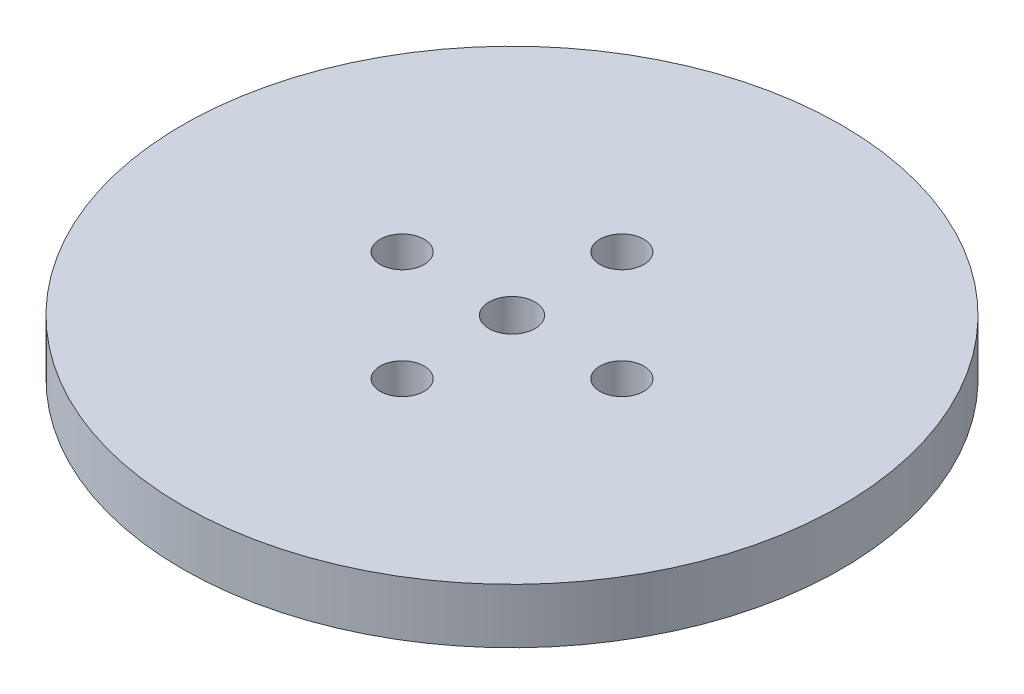
ISO-10303-21;
HEADER;
FILE_DESCRIPTION(('STEP AP214'),'2;1');
FILE_NAME('part.step','',(''),(''),'','','');
FILE_SCHEMA(('AUTOMOTIVE_DESIGN { 1 0 10303 214 1 1 1 1 }'));
ENDSEC;
DATA;
#1=APPLICATION_CONTEXT('core data for automotive mechanical design processes');
#2=APPLICATION_PROTOCOL_DEFINITION('international standard','automotive_design',2000,#1);
#3=PRODUCT_CONTEXT('',#1,'mechanical');
#4=PRODUCT('Part','Part','',(#3));
#5=PRODUCT_RELATED_PRODUCT_CATEGORY('part','',(#4));
#6=PRODUCT_DEFINITION_FORMATION('','',#4);
#7=PRODUCT_DEFINITION_CONTEXT('part definition',#1,'design');
#8=PRODUCT_DEFINITION('design','',#6,#7);
#9=PRODUCT_DEFINITION_SHAPE('','',#8);
#10=(LENGTH_UNIT() NAMED_UNIT(*) SI_UNIT(.MILLI.,.METRE.));
#11=(NAMED_UNIT(*) PLANE_ANGLE_UNIT() SI_UNIT($,.RADIAN.));
#12=(NAMED_UNIT(*) SI_UNIT($,.STERADIAN.) SOLID_ANGLE_UNIT());
#13=UNCERTAINTY_MEASURE_WITH_UNIT(LENGTH_MEASURE(1.E-05),#10,'distance_accuracy_value','');
#14=(GEOMETRIC_REPRESENTATION_CONTEXT(3) GLOBAL_UNCERTAINTY_ASSIGNED_CONTEXT((#13)) GLOBAL_UNIT_ASSIGNED_CONTEXT((#10,
#11,#12)) REPRESENTATION_CONTEXT('',''));
#15=CARTESIAN_POINT('',(0.,0.,0.));
#16=DIRECTION('',(0.,0.,1.));
#17=DIRECTION('',(1.,0.,0.));
#18=AXIS2_PLACEMENT_3D('',#15,#16,#17);
#19=CARTESIAN_POINT('',(0.,25.4,0.));
#20=DIRECTION('',(0.,-1.,0.));
#21=DIRECTION('',(0.,0.,-1.));
#22=AXIS2_PLACEMENT_3D('',#19,#20,#21);
#23=CYLINDRICAL_SURFACE('',#22,4.);
#24=CARTESIAN_POINT('',(0.,25.4,0.));
#25=DIRECTION('',(0.,1.,0.));
#26=DIRECTION('',(0.,0.,1.));
#27=AXIS2_PLACEMENT_3D('',#24,#25,#26);
#28=CIRCLE('',#27,4.);
#29=CARTESIAN_POINT('',(0.,25.4,4.));
#30=VERTEX_POINT('',#29);
#31=EDGE_CURVE('E10',#30,#30,#28,.T.);
#32=ORIENTED_EDGE('',*,*,#31,.F.);
#33=EDGE_LOOP('',(#32));
#34=FACE_BOUND('',#33,.T.);
#35=CARTESIAN_POINT('',(0.,23.,0.));
#36=DIRECTION('',(0.,-1.,0.));
#37=DIRECTION('',(0.,0.,-1.));
#38=AXIS2_PLACEMENT_3D('',#35,#36,#37);
#39=CIRCLE('',#38,4.);
#40=CARTESIAN_POINT('',(0.,23.,-4.));
#41=VERTEX_POINT('',#40);
#42=EDGE_CURVE('E64',#41,#41,#39,.T.);
#43=ORIENTED_EDGE('',*,*,#42,.F.);
#44=EDGE_LOOP('',(#43));
#45=FACE_BOUND('',#44,.T.);
#46=ADVANCED_FACE('F36',(#34,#45),#23,.T.);
#47=CARTESIAN_POINT('',(0.,30.4,0.));
#48=DIRECTION('',(0.,-1.,0.));
#49=DIRECTION('',(0.,0.,-1.));
#50=AXIS2_PLACEMENT_3D('',#47,#48,#49);
#51=CYLINDRICAL_SURFACE('',#50,30.);
#52=CARTESIAN_POINT('',(0.,30.4,0.));
#53=DIRECTION('',(0.,1.,0.));
#54=DIRECTION('',(0.,0.,1.));
#55=AXIS2_PLACEMENT_3D('',#52,#53,#54);
#56=CIRCLE('',#55,30.);
#57=CARTESIAN_POINT('',(0.,30.4,30.));
#58=VERTEX_POINT('',#57);
#59=EDGE_CURVE('E43',#58,#58,#56,.T.);
#60=ORIENTED_EDGE('',*,*,#59,.F.);
#61=EDGE_LOOP('',(#60));
#62=FACE_BOUND('',#61,.T.);
#63=CARTESIAN_POINT('',(0.,25.4,0.));
#64=DIRECTION('',(0.,1.,0.));
#65=DIRECTION('',(0.,0.,1.));
#66=AXIS2_PLACEMENT_3D('',#63,#64,#65);
#67=CIRCLE('',#66,30.);
#68=CARTESIAN_POINT('',(0.,25.4,30.));
#69=VERTEX_POINT('',#68);
#70=EDGE_CURVE('E48',#69,#69,#67,.T.);
#71=ORIENTED_EDGE('',*,*,#70,.T.);
#72=EDGE_LOOP('',(#71));
#73=FACE_BOUND('',#72,.T.);
#74=ADVANCED_FACE('F96',(#62,#73),#51,.T.);
#75=CARTESIAN_POINT('',(0.,30.4,0.));
#76=DIRECTION('',(0.,1.,0.));
#77=DIRECTION('',(0.,0.,1.));
#78=AXIS2_PLACEMENT_3D('',#75,#76,#77);
#79=PLANE('',#78);
#80=CARTESIAN_POINT('',(0.,30.4,0.));
#81=DIRECTION('',(0.,1.,0.));
#82=DIRECTION('',(0.,0.,1.));
#83=AXIS2_PLACEMENT_3D('',#80,#81,#82);
#84=CIRCLE('',#83,2.1);
#85=CARTESIAN_POINT('',(0.,30.4,2.1));
#86=VERTEX_POINT('',#85);
#87=EDGE_CURVE('E73',#86,#86,#84,.T.);
#88=ORIENTED_EDGE('',*,*,#87,.F.);
#89=EDGE_LOOP('',(#88));
#90=FACE_BOUND('',#89,.T.);
#91=CARTESIAN_POINT('',(0.,30.4,-10.));
#92=DIRECTION('',(0.,1.,0.));
#93=DIRECTION('',(0.,0.,1.));
#94=AXIS2_PLACEMENT_3D('',#91,#92,#93);
#95=CIRCLE('',#94,2.);
#96=CARTESIAN_POINT('',(0.,30.4,-8.));
#97=VERTEX_POINT('',#96);
#98=EDGE_CURVE('E56',#97,#97,#95,.T.);
#99=ORIENTED_EDGE('',*,*,#98,.F.);
#100=EDGE_LOOP('',(#99));
#101=FACE_BOUND('',#100,.T.);
#102=CARTESIAN_POINT('',(10.0000000000003,30.4,-2.82380124105319E-13));
#103=DIRECTION('',(0.,1.,0.));
#104=DIRECTION('',(0.,0.,1.));
#105=AXIS2_PLACEMENT_3D('',#102,#103,#104);
#106=CIRCLE('',#105,2.00000000000022);
#107=CARTESIAN_POINT('',(10.0000000000003,30.4,1.99999999999994));
#108=VERTEX_POINT('',#107);
#109=EDGE_CURVE('E83',#108,#108,#106,.T.);
#110=ORIENTED_EDGE('',*,*,#109,.F.);
#111=EDGE_LOOP('',(#110));
#112=FACE_BOUND('',#111,.T.);
#113=CARTESIAN_POINT('',(5.64760248210638E-13,30.4,10.));
#114=DIRECTION('',(0.,1.,0.));
#115=DIRECTION('',(0.,0.,1.));
#116=AXIS2_PLACEMENT_3D('',#113,#114,#115);
#117=CIRCLE('',#116,2.00000000000061);
#118=CARTESIAN_POINT('',(5.64760248210638E-13,30.4,12.0000000000006));
#119=VERTEX_POINT('',#118);
#120=EDGE_CURVE('E70',#119,#119,#117,.T.);
#121=ORIENTED_EDGE('',*,*,#120,.F.);
#122=EDGE_LOOP('',(#121));
#123=FACE_BOUND('',#122,.T.);
#124=CARTESIAN_POINT('',(-9.99999999999972,30.4,2.83604770904466E-13));
#125=DIRECTION('',(0.,1.,0.));
#126=DIRECTION('',(0.,0.,1.));
#127=AXIS2_PLACEMENT_3D('',#124,#125,#126);
#128=CIRCLE('',#127,2.00000000000045);
#129=CARTESIAN_POINT('',(-9.99999999999972,30.4,2.00000000000074));
#130=VERTEX_POINT('',#129);
#131=EDGE_CURVE('E66',#130,#130,#128,.T.);
#132=ORIENTED_EDGE('',*,*,#131,.F.);
#133=EDGE_LOOP('',(#132));
#134=FACE_BOUND('',#133,.T.);
#135=ORIENTED_EDGE('',*,*,#59,.T.);
#136=EDGE_LOOP('',(#135));
#137=FACE_BOUND('',#136,.T.);
#138=ADVANCED_FACE('F92',(#90,#101,#112,#123,#134,#137),#79,.T.);
#139=CARTESIAN_POINT('',(0.,25.4,0.));
#140=DIRECTION('',(0.,1.,0.));
#141=DIRECTION('',(0.,0.,1.));
#142=AXIS2_PLACEMENT_3D('',#139,#140,#141);
#143=PLANE('',#142);
#144=CARTESIAN_POINT('',(0.,25.4,-10.));
#145=DIRECTION('',(0.,1.,0.));
#146=DIRECTION('',(0.,0.,1.));
#147=AXIS2_PLACEMENT_3D('',#144,#145,#146);
#148=CIRCLE('',#147,2.);
#149=CARTESIAN_POINT('',(0.,25.4,-8.));
#150=VERTEX_POINT('',#149);
#151=EDGE_CURVE('E62',#150,#150,#148,.T.);
#152=ORIENTED_EDGE('',*,*,#151,.T.);
#153=EDGE_LOOP('',(#152));
#154=FACE_BOUND('',#153,.T.);
#155=CARTESIAN_POINT('',(10.0000000000003,25.4,-2.82380124105319E-13));
#156=DIRECTION('',(0.,1.,0.));
#157=DIRECTION('',(0.,0.,1.));
#158=AXIS2_PLACEMENT_3D('',#155,#156,#157);
#159=CIRCLE('',#158,2.00000000000022);
#160=CARTESIAN_POINT('',(10.0000000000003,25.4,1.99999999999994));
#161=VERTEX_POINT('',#160);
#162=EDGE_CURVE('E59',#161,#161,#159,.T.);
#163=ORIENTED_EDGE('',*,*,#162,.T.);
#164=EDGE_LOOP('',(#163));
#165=FACE_BOUND('',#164,.T.);
#166=CARTESIAN_POINT('',(5.64760248210638E-13,25.4,10.));
#167=DIRECTION('',(0.,1.,0.));
#168=DIRECTION('',(0.,0.,1.));
#169=AXIS2_PLACEMENT_3D('',#166,#167,#168);
#170=CIRCLE('',#169,2.00000000000061);
#171=CARTESIAN_POINT('',(5.64760248210638E-13,25.4,12.0000000000006));
#172=VERTEX_POINT('',#171);
#173=EDGE_CURVE('E55',#172,#172,#170,.T.);
#174=ORIENTED_EDGE('',*,*,#173,.T.);
#175=EDGE_LOOP('',(#174));
#176=FACE_BOUND('',#175,.T.);
#177=CARTESIAN_POINT('',(-9.99999999999972,25.4,2.83604770904466E-13));
#178=DIRECTION('',(0.,1.,0.));
#179=DIRECTION('',(0.,0.,1.));
#180=AXIS2_PLACEMENT_3D('',#177,#178,#179);
#181=CIRCLE('',#180,2.00000000000045);
#182=CARTESIAN_POINT('',(-9.99999999999972,25.4,2.00000000000074));
#183=VERTEX_POINT('',#182);
#184=EDGE_CURVE('E52',#183,#183,#181,.T.);
#185=ORIENTED_EDGE('',*,*,#184,.T.);
#186=EDGE_LOOP('',(#185));
#187=FACE_BOUND('',#186,.T.);
#188=ORIENTED_EDGE('',*,*,#31,.T.);
#189=EDGE_LOOP('',(#188));
#190=FACE_BOUND('',#189,.T.);
#191=ORIENTED_EDGE('',*,*,#70,.F.);
#192=EDGE_LOOP('',(#191));
#193=FACE_BOUND('',#192,.T.);
#194=ADVANCED_FACE('F95',(#154,#165,#176,#187,#190,#193),#143,.F.);
#195=CARTESIAN_POINT('',(-9.99999999999972,22.9,2.83604770904466E-13));
#196=DIRECTION('',(0.,1.,0.));
#197=DIRECTION('',(0.,0.,1.));
#198=AXIS2_PLACEMENT_3D('',#195,#196,#197);
#199=CYLINDRICAL_SURFACE('',#198,2.00000000000045);
#200=ORIENTED_EDGE('',*,*,#131,.T.);
#201=EDGE_LOOP('',(#200));
#202=FACE_BOUND('',#201,.T.);
#203=ORIENTED_EDGE('',*,*,#184,.F.);
#204=EDGE_LOOP('',(#203));
#205=FACE_BOUND('',#204,.T.);
#206=ADVANCED_FACE('F109',(#202,#205),#199,.F.);
#207=CARTESIAN_POINT('',(5.64760248210638E-13,22.9,10.));
#208=DIRECTION('',(0.,1.,0.));
#209=DIRECTION('',(0.,0.,1.));
#210=AXIS2_PLACEMENT_3D('',#207,#208,#209);
#211=CYLINDRICAL_SURFACE('',#210,2.00000000000061);
#212=ORIENTED_EDGE('',*,*,#120,.T.);
#213=EDGE_LOOP('',(#212));
#214=FACE_BOUND('',#213,.T.);
#215=ORIENTED_EDGE('',*,*,#173,.F.);
#216=EDGE_LOOP('',(#215));
#217=FACE_BOUND('',#216,.T.);
#218=ADVANCED_FACE('F89',(#214,#217),#211,.F.);
#219=CARTESIAN_POINT('',(10.0000000000003,22.9,-2.82380124105319E-13));
#220=DIRECTION('',(0.,1.,0.));
#221=DIRECTION('',(0.,0.,1.));
#222=AXIS2_PLACEMENT_3D('',#219,#220,#221);
#223=CYLINDRICAL_SURFACE('',#222,2.00000000000022);
#224=ORIENTED_EDGE('',*,*,#109,.T.);
#225=EDGE_LOOP('',(#224));
#226=FACE_BOUND('',#225,.T.);
#227=ORIENTED_EDGE('',*,*,#162,.F.);
#228=EDGE_LOOP('',(#227));
#229=FACE_BOUND('',#228,.T.);
#230=ADVANCED_FACE('F157',(#226,#229),#223,.F.);
#231=CARTESIAN_POINT('',(0.,22.9,-10.));
#232=DIRECTION('',(0.,1.,0.));
#233=DIRECTION('',(0.,0.,1.));
#234=AXIS2_PLACEMENT_3D('',#231,#232,#233);
#235=CYLINDRICAL_SURFACE('',#234,2.);
#236=ORIENTED_EDGE('',*,*,#98,.T.);
#237=EDGE_LOOP('',(#236));
#238=FACE_BOUND('',#237,.T.);
#239=ORIENTED_EDGE('',*,*,#151,.F.);
#240=EDGE_LOOP('',(#239));
#241=FACE_BOUND('',#240,.T.);
#242=ADVANCED_FACE('F130',(#238,#241),#235,.F.);
#243=CARTESIAN_POINT('',(0.,23.,0.));
#244=DIRECTION('',(0.,-1.,0.));
#245=DIRECTION('',(0.,0.,-1.));
#246=AXIS2_PLACEMENT_3D('',#243,#244,#245);
#247=PLANE('',#246);
#248=CARTESIAN_POINT('',(0.,23.,0.));
#249=DIRECTION('',(0.,-1.,0.));
#250=DIRECTION('',(0.,0.,-1.));
#251=AXIS2_PLACEMENT_3D('',#248,#249,#250);
#252=CIRCLE('',#251,2.1);
#253=CARTESIAN_POINT('',(0.,23.,-2.1));
#254=VERTEX_POINT('',#253);
#255=EDGE_CURVE('E39',#254,#254,#252,.T.);
#256=ORIENTED_EDGE('',*,*,#255,.F.);
#257=EDGE_LOOP('',(#256));
#258=FACE_BOUND('',#257,.T.);
#259=ORIENTED_EDGE('',*,*,#42,.T.);
#260=EDGE_LOOP('',(#259));
#261=FACE_BOUND('',#260,.T.);
#262=ADVANCED_FACE('F138',(#258,#261),#247,.T.);
#263=CARTESIAN_POINT('',(0.,10.4,0.));
#264=DIRECTION('',(0.,1.,0.));
#265=DIRECTION('',(0.,0.,1.));
#266=AXIS2_PLACEMENT_3D('',#263,#264,#265);
#267=CYLINDRICAL_SURFACE('',#266,2.1);
#268=ORIENTED_EDGE('',*,*,#255,.T.);
#269=EDGE_LOOP('',(#268));
#270=FACE_BOUND('',#269,.T.);
#271=ORIENTED_EDGE('',*,*,#87,.T.);
#272=EDGE_LOOP('',(#271));
#273=FACE_BOUND('',#272,.T.);
#274=ADVANCED_FACE('F142',(#270,#273),#267,.F.);
#275=CLOSED_SHELL('',(#46,#74,#138,#194,#206,#218,#230,#242,#262,#274));
#276=MANIFOLD_SOLID_BREP('B2',#275);
#277=ADVANCED_BREP_SHAPE_REPRESENTATION('',(#18,#276),#14);
#278=SHAPE_DEFINITION_REPRESENTATION(#9,#277);
ENDSEC;
END-ISO-10303-21;
